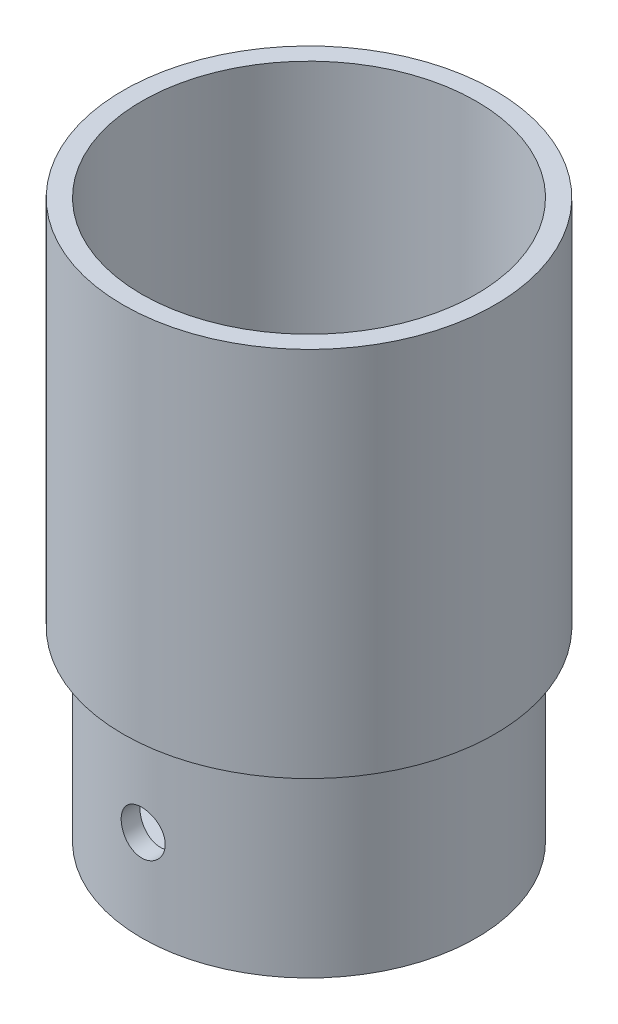
ISO-10303-21;
HEADER;
FILE_DESCRIPTION(('STEP AP214'),'2;1');
FILE_NAME('part.step','',(''),(''),'','','');
FILE_SCHEMA(('AUTOMOTIVE_DESIGN { 1 0 10303 214 1 1 1 1 }'));
ENDSEC;
DATA;
#1=APPLICATION_CONTEXT('core data for automotive mechanical design processes');
#2=APPLICATION_PROTOCOL_DEFINITION('international standard','automotive_design',2000,#1);
#3=PRODUCT_CONTEXT('',#1,'mechanical');
#4=PRODUCT('Part','Part','',(#3));
#5=PRODUCT_RELATED_PRODUCT_CATEGORY('part','',(#4));
#6=PRODUCT_DEFINITION_FORMATION('','',#4);
#7=PRODUCT_DEFINITION_CONTEXT('part definition',#1,'design');
#8=PRODUCT_DEFINITION('design','',#6,#7);
#9=PRODUCT_DEFINITION_SHAPE('','',#8);
#10=(LENGTH_UNIT() NAMED_UNIT(*) SI_UNIT(.MILLI.,.METRE.));
#11=(NAMED_UNIT(*) PLANE_ANGLE_UNIT() SI_UNIT($,.RADIAN.));
#12=(NAMED_UNIT(*) SI_UNIT($,.STERADIAN.) SOLID_ANGLE_UNIT());
#13=UNCERTAINTY_MEASURE_WITH_UNIT(LENGTH_MEASURE(1.E-05),#10,'distance_accuracy_value','');
#14=(GEOMETRIC_REPRESENTATION_CONTEXT(3) GLOBAL_UNCERTAINTY_ASSIGNED_CONTEXT((#13)) GLOBAL_UNIT_ASSIGNED_CONTEXT((#10,
#11,#12)) REPRESENTATION_CONTEXT('',''));
#15=CARTESIAN_POINT('',(0.,0.,0.));
#16=DIRECTION('',(0.,0.,1.));
#17=DIRECTION('',(1.,0.,0.));
#18=AXIS2_PLACEMENT_3D('',#15,#16,#17);
#19=CARTESIAN_POINT('',(0.,50.,0.));
#20=DIRECTION('',(0.,-1.,0.));
#21=DIRECTION('',(0.,0.,-1.));
#22=AXIS2_PLACEMENT_3D('',#19,#20,#21);
#23=CYLINDRICAL_SURFACE('',#22,45.);
#24=CARTESIAN_POINT('',(0.,30.4852633101779,-45.));
#25=CARTESIAN_POINT('',(-0.165602739226227,30.4852652960856,-45.0000006980719));
#26=CARTESIAN_POINT('',(-0.331176659897198,30.4783141520106,-44.9990840722904));
#27=CARTESIAN_POINT('',(-0.661192187234725,30.4505635068793,-44.9954446728699));
#28=CARTESIAN_POINT('',(-0.825633533508959,30.4297609219744,-44.9927214970259));
#29=CARTESIAN_POINT('',(-1.15227273725095,30.3744376839372,-44.985541916086));
#30=CARTESIAN_POINT('',(-1.31446887036562,30.3399070333473,-44.9810842478973));
#31=CARTESIAN_POINT('',(-1.6354060914179,30.2573704493001,-44.9705596376563));
#32=CARTESIAN_POINT('',(-1.79414589050943,30.2093595788339,-44.9644921060508));
#33=CARTESIAN_POINT('',(-2.10681880873609,30.100280049553,-44.9509263405974));
#34=CARTESIAN_POINT('',(-2.26075688414244,30.0392254024112,-44.9434296428879));
#35=CARTESIAN_POINT('',(-2.56298335612133,29.9044465244744,-44.927208109941));
#36=CARTESIAN_POINT('',(-2.71126964705121,29.8307176270241,-44.9184828225519));
#37=CARTESIAN_POINT('',(-3.00102411104392,29.6711775085326,-44.9000547965152));
#38=CARTESIAN_POINT('',(-3.14249592552196,29.5853728386916,-44.8903525886613));
#39=CARTESIAN_POINT('',(-3.41778284802502,29.4022235212981,-44.8702330958118));
#40=CARTESIAN_POINT('',(-3.55159509230303,29.3048745988471,-44.8598155465265));
#41=CARTESIAN_POINT('',(-3.81124226118932,29.0988218153305,-44.8385045412807));
#42=CARTESIAN_POINT('',(-3.93703339387869,28.9900629900847,-44.8276089439352));
#43=CARTESIAN_POINT('',(-4.17906669138164,28.7623195063106,-44.8056935692074));
#44=CARTESIAN_POINT('',(-4.29530530690043,28.6433310802118,-44.7946737473826));
#45=CARTESIAN_POINT('',(-4.51733735745226,28.3960296048563,-44.7728277772755));
#46=CARTESIAN_POINT('',(-4.62313407262495,28.267719505969,-44.7620015690535));
#47=CARTESIAN_POINT('',(-4.8236194793184,28.0025832278726,-44.7408411083437));
#48=CARTESIAN_POINT('',(-4.91830405870954,27.8657539245563,-44.730507038811));
#49=CARTESIAN_POINT('',(-5.09615041501729,27.5840950938397,-44.7105948199914));
#50=CARTESIAN_POINT('',(-5.17927206532667,27.439240031984,-44.7010193504172));
#51=CARTESIAN_POINT('',(-5.33303932531385,27.1429232306234,-44.6829350778253));
#52=CARTESIAN_POINT('',(-5.40368029103878,26.991459057957,-44.674426672193));
#53=CARTESIAN_POINT('',(-5.53190535373941,26.6830933196188,-44.6587304797958));
#54=CARTESIAN_POINT('',(-5.58949470018044,26.5261939693964,-44.6515421623025));
#55=CARTESIAN_POINT('',(-5.69124211427888,26.2080215287786,-44.6386867370429));
#56=CARTESIAN_POINT('',(-5.73539525322789,26.0467468569852,-44.6330201875854));
#57=CARTESIAN_POINT('',(-5.84666440864357,25.5600887711131,-44.6186329405704));
#58=CARTESIAN_POINT('',(-5.89347952542631,25.229725049942,-44.6124119766885));
#59=CARTESIAN_POINT('',(-5.93103499037306,24.5659567089546,-44.6074336672078));
#60=CARTESIAN_POINT('',(-5.92177782984717,24.2325522248977,-44.6086759900128));
#61=CARTESIAN_POINT('',(-5.84778711985859,23.5741755409795,-44.6184350316204));
#62=CARTESIAN_POINT('',(-5.78340564801423,23.2491632829478,-44.6269055827552));
#63=CARTESIAN_POINT('',(-5.60152391549611,22.6146087110283,-44.6500980576204));
#64=CARTESIAN_POINT('',(-5.4840224724664,22.3050667416519,-44.6648201204978));
#65=CARTESIAN_POINT('',(-5.1988659946871,21.7091353488346,-44.6989079438744));
#66=CARTESIAN_POINT('',(-5.03105887928966,21.4228195241428,-44.7182877496059));
#67=CARTESIAN_POINT('',(-4.6501617471528,20.8822790036918,-44.759497019881));
#68=CARTESIAN_POINT('',(-4.43706943637735,20.6280559347127,-44.7813266084981));
#69=CARTESIAN_POINT('',(-3.96970400656076,20.1568728461097,-44.8251807528828));
#70=CARTESIAN_POINT('',(-3.71512751498305,19.9402136458973,-44.8472055196468));
#71=CARTESIAN_POINT('',(-3.1730620432369,19.5526542490176,-44.888812024339));
#72=CARTESIAN_POINT('',(-2.88557297249947,19.3817541782749,-44.908393755544));
#73=CARTESIAN_POINT('',(-2.28560405892864,19.090560223312,-44.942921916731));
#74=CARTESIAN_POINT('',(-1.97311444023286,18.9702862514469,-44.9578665222235));
#75=CARTESIAN_POINT('',(-1.332133716924,18.7840030353496,-44.9814204142654));
#76=CARTESIAN_POINT('',(-1.00364344403722,18.7179909737234,-44.9900300297387));
#77=CARTESIAN_POINT('',(-0.342585910001201,18.6424977896412,-44.9999009224711));
#78=CARTESIAN_POINT('',(-0.0100667222296401,18.6326024781834,-45.0012160377143));
#79=CARTESIAN_POINT('',(0.651888078927484,18.6685290816453,-44.9964954073352));
#80=CARTESIAN_POINT('',(0.981323765081891,18.7143496783442,-44.9904598356279));
#81=CARTESIAN_POINT('',(1.62652995209473,18.8600632105735,-44.9717494518154));
#82=CARTESIAN_POINT('',(1.94234606168284,18.9597575930285,-44.9590990244207));
#83=CARTESIAN_POINT('',(2.55277797505874,19.21018166871,-44.9285745461136));
#84=CARTESIAN_POINT('',(2.84739298830586,19.3609132638037,-44.9107003005425));
#85=CARTESIAN_POINT('',(3.40890250396448,19.7101273240303,-44.8715850930635));
#86=CARTESIAN_POINT('',(3.67562985616852,19.9088764367082,-44.8503255652497));
#87=CARTESIAN_POINT('',(4.17208935747661,20.3481092218042,-44.8068732712481));
#88=CARTESIAN_POINT('',(4.40181987158219,20.5885947377007,-44.7846804638705));
#89=CARTESIAN_POINT('',(4.81924377005114,21.1062987685836,-44.741695474313));
#90=CARTESIAN_POINT('',(5.00666181756429,21.3837401950243,-44.7209130487079));
#91=CARTESIAN_POINT('',(5.3322340480126,21.9664206381172,-44.683266005724));
#92=CARTESIAN_POINT('',(5.47038930731056,22.2716590472388,-44.6664013027482));
#93=CARTESIAN_POINT('',(5.69307911959832,22.9003345882796,-44.6385648101359));
#94=CARTESIAN_POINT('',(5.77776633758819,23.2237170090512,-44.6275762564561));
#95=CARTESIAN_POINT('',(5.89158418656889,23.8804502683047,-44.6126963706914));
#96=CARTESIAN_POINT('',(5.92071770595236,24.2138005876123,-44.6088046696218));
#97=CARTESIAN_POINT('',(5.92215225825393,24.7123200521243,-44.6086083440165));
#98=CARTESIAN_POINT('',(5.91567761942845,24.8776912310413,-44.6094709040214));
#99=CARTESIAN_POINT('',(5.88892526035593,25.2072771157229,-44.6130114130493));
#100=CARTESIAN_POINT('',(5.86865268769549,25.3714922297046,-44.6156886850573));
#101=CARTESIAN_POINT('',(5.81443950913545,25.6976611300821,-44.6227859595752));
#102=CARTESIAN_POINT('',(5.78049394414966,25.859614073932,-44.6272065943769));
#103=CARTESIAN_POINT('',(5.69920467047371,26.180008394498,-44.6376606251521));
#104=CARTESIAN_POINT('',(5.65186582774958,26.3384510240586,-44.6436934353556));
#105=CARTESIAN_POINT('',(5.54413617938165,26.6507543875289,-44.6571998359716));
#106=CARTESIAN_POINT('',(5.48374653716861,26.8046155284712,-44.6646732979489));
#107=CARTESIAN_POINT('',(5.35037441326227,27.106645070667,-44.6808460258359));
#108=CARTESIAN_POINT('',(5.27739649417844,27.2548155108017,-44.6895448474064));
#109=CARTESIAN_POINT('',(5.11932385860098,27.5445524405905,-44.7079283051538));
#110=CARTESIAN_POINT('',(5.03422465824157,27.6861164605757,-44.7176133057551));
#111=CARTESIAN_POINT('',(4.85256199076153,27.9615597250764,-44.7376908956326));
#112=CARTESIAN_POINT('',(4.75600263452182,28.0954416998128,-44.7480832306131));
#113=CARTESIAN_POINT('',(4.55127306597554,28.3556687104583,-44.7693710428946));
#114=CARTESIAN_POINT('',(4.44301844147313,28.4819470773345,-44.7802698030547));
#115=CARTESIAN_POINT('',(4.21632153425253,28.7249041682835,-44.8021828938379));
#116=CARTESIAN_POINT('',(4.09788295161325,28.84158634899,-44.8131971812208));
#117=CARTESIAN_POINT('',(3.8515329838147,29.0646578811115,-44.835041988836));
#118=CARTESIAN_POINT('',(3.72361593316323,29.1710409874851,-44.8458723943265));
#119=CARTESIAN_POINT('',(3.45930950234515,29.3726509675784,-44.8670340472445));
#120=CARTESIAN_POINT('',(3.32292326929197,29.4678819478676,-44.8773654775819));
#121=CARTESIAN_POINT('',(3.04193858548534,29.6469699076332,-44.8972887068967));
#122=CARTESIAN_POINT('',(2.89730530036349,29.7307726500213,-44.9068768916614));
#123=CARTESIAN_POINT('',(2.60147602492128,29.8858499448168,-44.9249849611435));
#124=CARTESIAN_POINT('',(2.45028246891884,29.9571290956054,-44.9335052376421));
#125=CARTESIAN_POINT('',(2.14246805293296,30.0866254410577,-44.9492330541227));
#126=CARTESIAN_POINT('',(1.9858514702972,30.1448526710299,-44.9564416018532));
#127=CARTESIAN_POINT('',(1.66825418592253,30.2478691259702,-44.969347312378));
#128=CARTESIAN_POINT('',(1.50727451029162,30.2926614811466,-44.9750448271938));
#129=CARTESIAN_POINT('',(1.1245586090331,30.3818908416197,-44.9864842566963));
#130=CARTESIAN_POINT('',(0.901444900592205,30.4206147959806,-44.9915311263492));
#131=CARTESIAN_POINT('',(0.452202874935872,30.4722995652081,-44.9982885073289));
#132=CARTESIAN_POINT('',(0.22607458336464,30.4852605990918,-44.9999990470188));
#133=CARTESIAN_POINT('',(0.,30.4852633101779,-45.));
#134=B_SPLINE_CURVE_WITH_KNOTS('',3,(#24,#25,#26,#27,#28,#29,#30,#31,#32,#33,#34,#35,#36,#37,
#38,#39,#40,#41,#42,#43,#44,#45,#46,#47,#48,#49,#50,#51,#52,#53,#54,#55,#56,#57,#58,#59,#60,#61,
#62,#63,#64,#65,#66,#67,#68,#69,#70,#71,#72,#73,#74,#75,#76,#77,#78,#79,#80,#81,#82,#83,#84,#85,
#86,#87,#88,#89,#90,#91,#92,#93,#94,#95,#96,#97,#98,#99,#100,#101,#102,#103,#104,#105,#106,#107,
#108,#109,#110,#111,#112,#113,#114,#115,#116,#117,#118,#119,#120,#121,#122,#123,#124,#125,#126,
#127,#128,#129,#130,#131,#132,#133),.UNSPECIFIED.,.T.,.F.,(4,2,2,2,2,2,2,2,2,2,2,2,2,2,2,2,2,2,
2,2,2,2,2,2,2,2,2,2,2,2,2,2,2,2,2,2,2,2,2,2,2,2,2,2,2,2,2,2,2,2,2,2,2,2,4),(0.,
0.496610337576612,0.993331276166085,1.49041461612751,1.98768024637981,2.48441437402993,
2.9813317923341,3.4779806608907,3.97481401887093,4.47416138591716,4.9736934574148,
5.47306810688093,5.97262697485643,6.47387836927584,6.9753158839164,7.4765513570414,
7.97797047378749,8.97392015475526,9.96982558566901,10.9594172410026,11.9490309239686,
12.941667037355,13.934353447224,14.9346551161919,15.9349595378611,16.9356570343873,
17.9363025692837,18.9295527857819,19.9227795027521,20.9123703797516,21.9019981372455,
22.8972531189508,23.892552071822,24.8941520813165,25.895730205102,26.8944354767318,
27.8930888214567,28.389106303207,28.8849388373816,29.3809513682594,29.876783921718,
30.3725722917492,30.8681813398811,31.3639742005737,31.8595897495284,32.3590574770706,
32.858344496521,33.3579323964764,33.8573357498381,34.359032346758,34.8605443452392,
35.3616694103447,35.8626776268343,36.5406370020451,37.2185906137232),.UNSPECIFIED.);
#135=CARTESIAN_POINT('',(0.,30.4852633101779,-45.));
#136=VERTEX_POINT('',#135);
#137=EDGE_CURVE('E104',#136,#136,#134,.T.);
#138=ORIENTED_EDGE('',*,*,#137,.T.);
#139=EDGE_LOOP('',(#138));
#140=FACE_BOUND('',#139,.T.);
#141=CARTESIAN_POINT('',(5.92169968593746,24.5635636242404,44.6086703772884));
#142=CARTESIAN_POINT('',(5.9217016730348,24.3979678671453,44.6086696567049));
#143=CARTESIAN_POINT('',(5.91475110936843,24.2324009281947,44.6095943150669));
#144=CARTESIAN_POINT('',(5.88700283926012,23.9023995523414,44.6132648844858));
#145=CARTESIAN_POINT('',(5.86620204828423,23.7379653759559,44.6160112012371));
#146=CARTESIAN_POINT('',(5.81088371792735,23.411340669543,44.6232495980462));
#147=CARTESIAN_POINT('',(5.77635617149235,23.2491518658959,44.6277429516727));
#148=CARTESIAN_POINT('',(5.69382724752291,22.9282294581597,44.6383474317248));
#149=CARTESIAN_POINT('',(5.64582093210228,22.7694971433468,44.6444591509846));
#150=CARTESIAN_POINT('',(5.53675240314594,22.4568401449208,44.6581166999491));
#151=CARTESIAN_POINT('',(5.47570429293044,22.302910472211,44.6656609795197));
#152=CARTESIAN_POINT('',(5.3409400747721,22.0007000811478,44.6819758365931));
#153=CARTESIAN_POINT('',(5.26721930043444,21.8524214683163,44.6907468655936));
#154=CARTESIAN_POINT('',(5.10769667140649,21.5626809844646,44.7092593905481));
#155=CARTESIAN_POINT('',(5.02190135924115,21.4212154771502,44.7190003601143));
#156=CARTESIAN_POINT('',(4.83877161808571,21.1459394299342,44.7391861206929));
#157=CARTESIAN_POINT('',(4.74143291434267,21.0121317532498,44.7496311718191));
#158=CARTESIAN_POINT('',(4.53539034191461,20.7524782843321,44.7709840545992));
#159=CARTESIAN_POINT('',(4.42663038442528,20.6266771708279,44.7818939973369));
#160=CARTESIAN_POINT('',(4.19888252413321,20.3846238258208,44.8038220910266));
#161=CARTESIAN_POINT('',(4.07989085285579,20.2683751436991,44.8148402805123));
#162=CARTESIAN_POINT('',(3.83258089040819,20.0463234045482,44.836667185884));
#163=CARTESIAN_POINT('',(3.70426556303188,19.9405170531245,44.8474759669647));
#164=CARTESIAN_POINT('',(3.43911686134805,19.7400131241953,44.8685877426091));
#165=CARTESIAN_POINT('',(3.30228036271732,19.6453196584219,44.878890549149));
#166=CARTESIAN_POINT('',(3.02061584858071,19.4674632543562,44.8987290655279));
#167=CARTESIAN_POINT('',(2.87576284646978,19.3843395777164,44.9082621194037));
#168=CARTESIAN_POINT('',(2.5794500079191,19.2305680477487,44.9262560388212));
#169=CARTESIAN_POINT('',(2.42798773831768,19.1599248381807,44.9347165049427));
#170=CARTESIAN_POINT('',(2.11962588073288,19.0316951485964,44.9503167899435));
#171=CARTESIAN_POINT('',(1.9627285035851,18.9741034298892,44.9574571384873));
#172=CARTESIAN_POINT('',(1.64456041600793,18.8723511715924,44.9702219526336));
#173=CARTESIAN_POINT('',(1.48328812404858,18.8281955615638,44.9758458617851));
#174=CARTESIAN_POINT('',(0.996640912405773,18.7169193349983,44.9901213890121));
#175=CARTESIAN_POINT('',(0.666286657806594,18.6700987796061,44.9962888178975));
#176=CARTESIAN_POINT('',(0.00253689835840712,18.6325291678985,45.0012260090894));
#177=CARTESIAN_POINT('',(-0.330858474019623,18.641777680753,44.999996092102));
#178=CARTESIAN_POINT('',(-0.989272906802057,18.715754553318,44.9903214860683));
#179=CARTESIAN_POINT('',(-1.31433101105653,18.7801395452418,44.9819214506786));
#180=CARTESIAN_POINT('',(-1.94897544915129,18.9620441535392,44.9588970410598));
#181=CARTESIAN_POINT('',(-2.25856146212664,19.0795648713503,44.9442725378056));
#182=CARTESIAN_POINT('',(-2.85454681202467,19.3647615556432,44.9103663245768));
#183=CARTESIAN_POINT('',(-3.14087470108977,19.5325851552536,44.8910709386206));
#184=CARTESIAN_POINT('',(-3.68143238872088,19.9135176301081,44.8499794565339));
#185=CARTESIAN_POINT('',(-3.93566055560159,20.1266288059231,44.8281832333888));
#186=CARTESIAN_POINT('',(-4.40682288383316,20.5940078013227,44.7843324945592));
#187=CARTESIAN_POINT('',(-4.62346001811732,20.8485750961447,44.7622772728799));
#188=CARTESIAN_POINT('',(-5.01097924949364,21.3906142402718,44.7205567238754));
#189=CARTESIAN_POINT('',(-5.18186117369274,21.6780862139065,44.7008914055812));
#190=CARTESIAN_POINT('',(-5.47304199870023,22.2780501151631,44.666177688701));
#191=CARTESIAN_POINT('',(-5.59331545150944,22.5905545363309,44.6511316138844));
#192=CARTESIAN_POINT('',(-5.77959311096391,23.2315674908503,44.627404166128));
#193=CARTESIAN_POINT('',(-5.84560022715689,23.5600751651698,44.6187224519589));
#194=CARTESIAN_POINT('',(-5.92107471779648,24.2211413922611,44.6087697264911));
#195=CARTESIAN_POINT('',(-5.93096085197011,24.5536513392529,44.6074438297479));
#196=CARTESIAN_POINT('',(-5.89501919180575,25.2155854685304,44.6122075719548));
#197=CARTESIAN_POINT('',(-5.84919271714199,25.5450097237212,44.6182970352559));
#198=CARTESIAN_POINT('',(-5.70347994096159,26.1901559868361,44.6371552074326));
#199=CARTESIAN_POINT('',(-5.60379785076824,26.505924919519,44.6498986793565));
#200=CARTESIAN_POINT('',(-5.35341411996417,27.1162679025646,44.6806084610385));
#201=CARTESIAN_POINT('',(-5.20271050432071,27.4108411319108,44.6985749729754));
#202=CARTESIAN_POINT('',(-4.85353816800043,27.9723212061262,44.7378374234563));
#203=CARTESIAN_POINT('',(-4.65479570607237,28.2390564781002,44.7591521885412));
#204=CARTESIAN_POINT('',(-4.21557142909375,28.7355350467972,44.8026509808007));
#205=CARTESIAN_POINT('',(-3.97508781072448,28.9652767444814,44.824835045499));
#206=CARTESIAN_POINT('',(-3.45737910698005,29.3827262004716,44.8677423324108));
#207=CARTESIAN_POINT('',(-3.17993073109918,29.5701582076672,44.8884554003544));
#208=CARTESIAN_POINT('',(-2.59723253501294,29.8957549114998,44.9259331164041));
#209=CARTESIAN_POINT('',(-2.29198332662359,30.0339206920154,44.9426978513727));
#210=CARTESIAN_POINT('',(-1.66331347468755,30.2566171675289,44.9703469641802));
#211=CARTESIAN_POINT('',(-1.33994916891306,30.3413050835821,44.9812485650623));
#212=CARTESIAN_POINT('',(-0.683254273459226,30.4551304790413,44.9960077160057));
#213=CARTESIAN_POINT('',(-0.349924185240251,30.4842707487434,44.9998656198889));
#214=CARTESIAN_POINT('',(0.148590951351719,30.4857204446677,45.0000620264808));
#215=CARTESIAN_POINT('',(0.313977245864337,30.4792496454715,44.9992075777103));
#216=CARTESIAN_POINT('',(0.643593802819265,30.4525023918654,44.995698154543));
#217=CARTESIAN_POINT('',(0.807824473276999,30.4322310855313,44.9930438515568));
#218=CARTESIAN_POINT('',(1.13402473259007,30.3780177645708,44.9860049414306));
#219=CARTESIAN_POINT('',(1.29599348082889,30.3440708004563,44.9816197078447));
#220=CARTESIAN_POINT('',(1.61641946878476,30.2627759350043,44.9712448981201));
#221=CARTESIAN_POINT('',(1.77487796184981,30.2154329027311,44.9652559049417));
#222=CARTESIAN_POINT('',(2.08721449077045,30.1076914236804,44.9518405889219));
#223=CARTESIAN_POINT('',(2.24109288021488,30.0472939877064,44.944414377369));
#224=CARTESIAN_POINT('',(2.54315572749954,29.913903315238,44.928334358059));
#225=CARTESIAN_POINT('',(2.69134222529819,29.8409146438929,44.9196809954264));
#226=CARTESIAN_POINT('',(2.98110930216512,29.6828179329743,44.9013816442419));
#227=CARTESIAN_POINT('',(3.12268741511332,29.5977054162741,44.8917352893618));
#228=CARTESIAN_POINT('',(3.39815634165586,29.4160140350217,44.8717238502038));
#229=CARTESIAN_POINT('',(3.53204988722647,29.3194392833951,44.8613590242827));
#230=CARTESIAN_POINT('',(3.79227692832766,29.1146932274458,44.8401138606804));
#231=CARTESIAN_POINT('',(3.91854507460976,29.0064391995203,44.8292301978482));
#232=CARTESIAN_POINT('',(4.16148159521089,28.7797456016103,44.8073313661442));
#233=CARTESIAN_POINT('',(4.27815342612928,28.6613097308501,44.796316246275));
#234=CARTESIAN_POINT('',(4.50120460747079,28.4149672337529,44.7744539443036));
#235=CARTESIAN_POINT('',(4.60757770105156,28.2870549324143,44.763606867613));
#236=CARTESIAN_POINT('',(4.80916836181596,28.0227599935862,44.7423979230603));
#237=CARTESIAN_POINT('',(4.90439003373144,27.8863805012528,44.7320358775113));
#238=CARTESIAN_POINT('',(5.083466902606,27.6054009478394,44.7120400248784));
#239=CARTESIAN_POINT('',(5.16726702301953,27.4607655172349,44.7024098391618));
#240=CARTESIAN_POINT('',(5.32233886108176,27.1649321891721,44.6842120256213));
#241=CARTESIAN_POINT('',(5.393615177373,27.013736726042,44.6756440081191));
#242=CARTESIAN_POINT('',(5.52310572005785,26.7059185356916,44.6598204214201));
#243=CARTESIAN_POINT('',(5.58132999542204,26.5493000917144,44.6525638433654));
#244=CARTESIAN_POINT('',(5.68434047461924,26.2316987389223,44.6395672145619));
#245=CARTESIAN_POINT('',(5.72912981110023,26.0707168570983,44.6338268103216));
#246=CARTESIAN_POINT('',(5.81834632380437,25.6880189360763,44.6222990496288));
#247=CARTESIAN_POINT('',(5.8570630811233,25.4649258834582,44.6172106031646));
#248=CARTESIAN_POINT('',(5.90873829287289,25.0157251769394,44.6103967735841));
#249=CARTESIAN_POINT('',(5.921696973361,24.7896175495126,44.6086713609533));
#250=CARTESIAN_POINT('',(5.92169968593746,24.5635636242404,44.6086703772884));
#251=B_SPLINE_CURVE_WITH_KNOTS('',3,(#141,#142,#143,#144,#145,#146,#147,#148,#149,#150,#151,
#152,#153,#154,#155,#156,#157,#158,#159,#160,#161,#162,#163,#164,#165,#166,#167,#168,#169,#170,
#171,#172,#173,#174,#175,#176,#177,#178,#179,#180,#181,#182,#183,#184,#185,#186,#187,#188,#189,
#190,#191,#192,#193,#194,#195,#196,#197,#198,#199,#200,#201,#202,#203,#204,#205,#206,#207,#208,
#209,#210,#211,#212,#213,#214,#215,#216,#217,#218,#219,#220,#221,#222,#223,#224,#225,#226,#227,
#228,#229,#230,#231,#232,#233,#234,#235,#236,#237,#238,#239,#240,#241,#242,#243,#244,#245,#246,
#247,#248,#249,#250),.UNSPECIFIED.,.T.,.F.,(4,2,2,2,2,2,2,2,2,2,2,2,2,2,2,2,2,2,2,2,2,2,2,2,2,2,
2,2,2,2,2,2,2,2,2,2,2,2,2,2,2,2,2,2,2,2,2,2,2,2,2,2,2,2,4),(0.,0.496589368233186,
0.993289367092624,1.49035213523076,1.98759723820275,2.48430732081328,2.98120069794551,
3.47782586524283,3.97463552064754,4.47401045240085,4.97357010485555,5.47297164673184,
5.97255738687406,6.47379914469758,6.97522701466852,7.47645326042096,7.97786317947545,
8.97378565933328,9.96966496206864,10.9593870596436,11.9491296738671,12.9418059937779,
13.9345327528744,14.9347779020586,15.9350268307689,16.9357781260266,17.9364757614326,
18.9296965442686,19.9228938009699,20.9123511866886,21.9018468784789,22.8971197813603,
23.8924356931408,24.8940623801196,25.8956670295118,26.8943131537475,27.8929091121861,
28.3889713241985,28.884848588833,29.3809054826158,29.8767823058662,30.3726207470821,
30.8682797907069,31.3641223494739,31.8597875228658,32.359227972349,32.8584877279399,
33.3580489225532,33.8574256516141,34.3591311460775,34.8606520314768,35.3617854516937,
35.8628019307664,36.5406994995091,37.2185911188762),.UNSPECIFIED.);
#252=CARTESIAN_POINT('',(5.92169968593746,24.5635636242404,44.6086703772884));
#253=VERTEX_POINT('',#252);
#254=EDGE_CURVE('E99',#253,#253,#251,.T.);
#255=ORIENTED_EDGE('',*,*,#254,.T.);
#256=EDGE_LOOP('',(#255));
#257=FACE_BOUND('',#256,.T.);
#258=CARTESIAN_POINT('',(0.,50.,0.));
#259=DIRECTION('',(0.,1.,0.));
#260=DIRECTION('',(0.,0.,1.));
#261=AXIS2_PLACEMENT_3D('',#258,#259,#260);
#262=CIRCLE('',#261,45.);
#263=CARTESIAN_POINT('',(0.,50.,45.));
#264=VERTEX_POINT('',#263);
#265=EDGE_CURVE('E12',#264,#264,#262,.T.);
#266=ORIENTED_EDGE('',*,*,#265,.F.);
#267=EDGE_LOOP('',(#266));
#268=FACE_BOUND('',#267,.T.);
#269=CARTESIAN_POINT('',(0.,0.,0.));
#270=DIRECTION('',(0.,1.,0.));
#271=DIRECTION('',(0.,0.,1.));
#272=AXIS2_PLACEMENT_3D('',#269,#270,#271);
#273=CIRCLE('',#272,45.);
#274=CARTESIAN_POINT('',(0.,0.,45.));
#275=VERTEX_POINT('',#274);
#276=EDGE_CURVE('E93',#275,#275,#273,.T.);
#277=ORIENTED_EDGE('',*,*,#276,.T.);
#278=EDGE_LOOP('',(#277));
#279=FACE_BOUND('',#278,.T.);
#280=ADVANCED_FACE('F51',(#140,#257,#268,#279),#23,.T.);
#281=CARTESIAN_POINT('',(0.,0.,0.));
#282=DIRECTION('',(0.,1.,0.));
#283=DIRECTION('',(0.,0.,1.));
#284=AXIS2_PLACEMENT_3D('',#281,#282,#283);
#285=PLANE('',#284);
#286=DIRECTION('',(0.,0.,1.));
#287=VECTOR('',#286,1.);
#288=CARTESIAN_POINT('',(-3.01226675034075,0.,7.71893354774802));
#289=LINE('',#288,#287);
#290=CARTESIAN_POINT('',(-3.01226675034075,0.,-5.80650011790681));
#291=VERTEX_POINT('',#290);
#292=CARTESIAN_POINT('',(-3.01226675034075,0.,5.80650011790681));
#293=VERTEX_POINT('',#292);
#294=EDGE_CURVE('E81',#291,#293,#289,.T.);
#295=ORIENTED_EDGE('',*,*,#294,.T.);
#296=CARTESIAN_POINT('',(0.,0.,0.));
#297=DIRECTION('',(0.,-1.,0.));
#298=DIRECTION('',(0.,0.,-1.));
#299=AXIS2_PLACEMENT_3D('',#296,#297,#298);
#300=CIRCLE('',#299,6.54134501417409);
#301=EDGE_CURVE('E74',#291,#293,#300,.T.);
#302=ORIENTED_EDGE('',*,*,#301,.F.);
#303=EDGE_LOOP('',(#295,#302));
#304=FACE_BOUND('',#303,.T.);
#305=ORIENTED_EDGE('',*,*,#276,.F.);
#306=EDGE_LOOP('',(#305));
#307=FACE_BOUND('',#306,.T.);
#308=ADVANCED_FACE('F78',(#304,#307),#285,.F.);
#309=CARTESIAN_POINT('',(0.,10.,0.));
#310=DIRECTION('',(0.,1.,0.));
#311=DIRECTION('',(0.,0.,1.));
#312=AXIS2_PLACEMENT_3D('',#309,#310,#311);
#313=CYLINDRICAL_SURFACE('',#312,40.);
#314=CARTESIAN_POINT('',(0.,18.6418639383029,40.));
#315=CARTESIAN_POINT('',(0.165400078830967,18.6418617144572,40.0000008702031));
#316=CARTESIAN_POINT('',(0.330768869389246,18.6487959771474,39.9989721460615));
#317=CARTESIAN_POINT('',(0.660372723269405,18.6764777295679,39.9948878579096));
#318=CARTESIAN_POINT('',(0.824607538964431,18.697228145605,39.9918318645174));
#319=CARTESIAN_POINT('',(1.15082526057968,18.7524090491233,39.9837748246962));
#320=CARTESIAN_POINT('',(1.31280654339526,18.7868489169138,39.9787724446105));
#321=CARTESIAN_POINT('',(1.63331522450072,18.8691635115868,39.9669614411459));
#322=CARTESIAN_POINT('',(1.79184133351693,18.9170431639772,39.9601521556096));
#323=CARTESIAN_POINT('',(2.10408302771323,19.0258146811797,39.9449276165464));
#324=CARTESIAN_POINT('',(2.25780382894313,19.0866918323822,39.9365141801153));
#325=CARTESIAN_POINT('',(2.55960719667997,19.2210703840971,39.9183075341426));
#326=CARTESIAN_POINT('',(2.70768766131692,19.2945764356104,39.9085138165075));
#327=CARTESIAN_POINT('',(2.99705283787668,19.4536277220235,39.8878265497214));
#328=CARTESIAN_POINT('',(3.13834104835595,19.539166667905,39.8769335759342));
#329=CARTESIAN_POINT('',(3.41328884008039,19.7217427393424,39.8543410019326));
#330=CARTESIAN_POINT('',(3.54694556332148,19.8187841312739,39.8426411030985));
#331=CARTESIAN_POINT('',(3.80649776046817,20.0243256089331,39.8186849719143));
#332=CARTESIAN_POINT('',(3.93233766250083,20.1328955137263,39.8064256400375));
#333=CARTESIAN_POINT('',(4.17448772381301,20.3602586723982,39.7817605571756));
#334=CARTESIAN_POINT('',(4.29079433944853,20.4790556944867,39.7693547536877));
#335=CARTESIAN_POINT('',(4.51298639561086,20.7259788094251,39.744753710526));
#336=CARTESIAN_POINT('',(4.6188750597979,20.8541019949644,39.7325584066857));
#337=CARTESIAN_POINT('',(4.81957012757754,21.11887532982,39.7087139424585));
#338=CARTESIAN_POINT('',(4.9143724290426,21.255528606898,39.6970649851771));
#339=CARTESIAN_POINT('',(5.09257400934061,21.5370006127339,39.6745988702489));
#340=CARTESIAN_POINT('',(5.17592081666203,21.6818528869507,39.6637856333881));
#341=CARTESIAN_POINT('',(5.33013569627396,21.9782015399707,39.6433563939914));
#342=CARTESIAN_POINT('',(5.40099911634803,22.1297003696022,39.6337408381879));
#343=CARTESIAN_POINT('',(5.52966002807093,22.4381726231679,39.6159953809916));
#344=CARTESIAN_POINT('',(5.58746288836358,22.5951437669251,39.6078648694242));
#345=CARTESIAN_POINT('',(5.68962268364769,22.9134962672842,39.5933178299288));
#346=CARTESIAN_POINT('',(5.73397469534275,23.0748792151959,39.5869019296868));
#347=CARTESIAN_POINT('',(5.84569322261417,23.56141766799,39.5706182063196));
#348=CARTESIAN_POINT('',(5.89281075771314,23.8915822484494,39.5635589518244));
#349=CARTESIAN_POINT('',(5.93102091141989,24.5550206989515,39.5578477908504));
#350=CARTESIAN_POINT('',(5.922116664568,24.8882943939907,39.5591954139884));
#351=CARTESIAN_POINT('',(5.84893951167782,25.5458727606651,39.570080060009));
#352=CARTESIAN_POINT('',(5.7851141246783,25.8702281152787,39.5795508897989));
#353=CARTESIAN_POINT('',(5.60458700336931,26.5035615575079,39.6055153057122));
#354=CARTESIAN_POINT('',(5.48788380878263,26.8125392201906,39.6220090857811));
#355=CARTESIAN_POINT('',(5.20445223325418,27.4077265710488,39.6602332480476));
#356=CARTESIAN_POINT('',(5.03753383096207,27.693844455535,39.6819834587139));
#357=CARTESIAN_POINT('',(4.65854400852798,28.2341785585408,39.7282556455344));
#358=CARTESIAN_POINT('',(4.44646970063144,28.4883927351405,39.7527777989092));
#359=CARTESIAN_POINT('',(3.98072925346208,28.9602990664583,39.8021234984816));
#360=CARTESIAN_POINT('',(3.72667815917648,29.1776114137,39.8269476540308));
#361=CARTESIAN_POINT('',(3.18550877645347,29.5665725804101,39.8738783881646));
#362=CARTESIAN_POINT('',(2.89839034992984,29.7382212091809,39.8959849554));
#363=CARTESIAN_POINT('',(2.29891042700077,30.0310004450349,39.935011935153));
#364=CARTESIAN_POINT('',(1.9865346423812,30.1521022154286,39.9519293858546));
#365=CARTESIAN_POINT('',(1.34557361537365,30.340022316051,39.9786470826469));
#366=CARTESIAN_POINT('',(1.01698944165183,30.4068442200481,39.9884477972965));
#367=CARTESIAN_POINT('',(0.356217470666942,30.4838038047811,39.9997657881593));
#368=CARTESIAN_POINT('',(0.0240917580591412,30.4944637346497,40.0013593791222));
#369=CARTESIAN_POINT('',(-0.637205092292992,30.4601823035625,39.9962911616265));
#370=CARTESIAN_POINT('',(-0.966376318762549,30.415242617966,39.9896296019168));
#371=CARTESIAN_POINT('',(-1.61084179447009,30.2714718973866,39.9688467993733));
#372=CARTESIAN_POINT('',(-1.92619393379281,30.1728948407002,39.9547607221338));
#373=CARTESIAN_POINT('',(-2.53589427082073,29.9249150454819,39.9207034009846));
#374=CARTESIAN_POINT('',(-2.83024150361055,29.7755099738481,39.900731886928));
#375=CARTESIAN_POINT('',(-3.39187612314006,29.4288870633284,39.8569339371677));
#376=CARTESIAN_POINT('',(-3.65895661761181,29.2313373886891,39.8330811463652));
#377=CARTESIAN_POINT('',(-4.15635948895594,28.7944944192866,39.7842588884263));
#378=CARTESIAN_POINT('',(-4.38667978641743,28.5551987646835,39.7592893582216));
#379=CARTESIAN_POINT('',(-4.80592102565566,28.0393380826092,39.7108062447814));
#380=CARTESIAN_POINT('',(-4.99449220557475,27.7624873797781,39.6873060647639));
#381=CARTESIAN_POINT('',(-5.32245090002613,27.1807204767594,39.6446590254004));
#382=CARTESIAN_POINT('',(-5.46183971615591,26.8758050195669,39.6255120508529));
#383=CARTESIAN_POINT('',(-5.68693860089773,26.2476770197108,39.5938337034641));
#384=CARTESIAN_POINT('',(-5.77283382137528,25.924531858227,39.5812795355479));
#385=CARTESIAN_POINT('',(-5.88907565757714,25.2680193203855,39.5641553772984));
#386=CARTESIAN_POINT('',(-5.91942600134509,24.9346526316002,39.5595848511224));
#387=CARTESIAN_POINT('',(-5.92264532209906,24.43630533077,39.559096281038));
#388=CARTESIAN_POINT('',(-5.91678507600111,24.2711987874397,39.5599769223377));
#389=CARTESIAN_POINT('',(-5.89130579429709,23.9420911023502,39.5637805084622));
#390=CARTESIAN_POINT('',(-5.87169190607423,23.77808957021,39.5667026892271));
#391=CARTESIAN_POINT('',(-5.81883766614554,23.4522965210023,39.5745098268553));
#392=CARTESIAN_POINT('',(-5.78559240376393,23.2905058221103,39.579395491047));
#393=CARTESIAN_POINT('',(-5.70574258109936,22.9703819118837,39.5909854621127));
#394=CARTESIAN_POINT('',(-5.65914285310648,22.8120474721701,39.5976891111051));
#395=CARTESIAN_POINT('',(-5.55294296457809,22.4999467116672,39.6127213891564));
#396=CARTESIAN_POINT('',(-5.49334759087919,22.3461787324933,39.6210494197692));
#397=CARTESIAN_POINT('',(-5.36160415412422,22.044269162369,39.6390920298834));
#398=CARTESIAN_POINT('',(-5.28946061599096,21.8961255666219,39.6488061093434));
#399=CARTESIAN_POINT('',(-5.13309164074484,21.6063671922669,39.6693532528419));
#400=CARTESIAN_POINT('',(-5.04886161291703,21.4647549215296,39.6801867416171));
#401=CARTESIAN_POINT('',(-4.86896462031739,21.1891326826786,39.7026623053459));
#402=CARTESIAN_POINT('',(-4.77330172106773,21.0551200369909,39.7143040922558));
#403=CARTESIAN_POINT('',(-4.57019070407811,20.7942836289547,39.7381920938932));
#404=CARTESIAN_POINT('',(-4.46263683464023,20.6675426382908,39.7504430928029));
#405=CARTESIAN_POINT('',(-4.2373083903589,20.4235991841804,39.7750933913233));
#406=CARTESIAN_POINT('',(-4.11953750653828,20.306393305464,39.7874926359942));
#407=CARTESIAN_POINT('',(-3.8744815702412,20.0822118888396,39.8121032110038));
#408=CARTESIAN_POINT('',(-3.74719085496459,19.9752425276747,39.8243144242016));
#409=CARTESIAN_POINT('',(-3.48408453389112,19.7723983310384,39.8481943618067));
#410=CARTESIAN_POINT('',(-3.34827209406089,19.6765194124817,39.8598632849123));
#411=CARTESIAN_POINT('',(-3.06821416783286,19.4959700409502,39.8824009458096));
#412=CARTESIAN_POINT('',(-2.92392473680445,19.4113671079698,39.8932647042213));
#413=CARTESIAN_POINT('',(-2.62869672332894,19.2546653792085,39.9138051262459));
#414=CARTESIAN_POINT('',(-2.47776060993307,19.182561988531,39.9234822256965));
#415=CARTESIAN_POINT('',(-2.17036555987521,19.0514008063224,39.9413718923097));
#416=CARTESIAN_POINT('',(-2.01391078666621,18.9923334142425,39.9495855363904));
#417=CARTESIAN_POINT('',(-1.69654640791612,18.8876334777205,39.9643213096662));
#418=CARTESIAN_POINT('',(-1.53563781315937,18.8419979118678,39.9708438192328));
#419=CARTESIAN_POINT('',(-1.14849834618518,18.7497249875036,39.9841385234719));
#420=CARTESIAN_POINT('',(-0.920722959340329,18.7093219705769,39.9900602193901));
#421=CARTESIAN_POINT('',(-0.461944689943075,18.6553931590651,39.9979903267622));
#422=CARTESIAN_POINT('',(-0.230941845983207,18.6418670433743,39.9999987849685));
#423=CARTESIAN_POINT('',(0.,18.6418639383029,40.));
#424=B_SPLINE_CURVE_WITH_KNOTS('',3,(#314,#315,#316,#317,#318,#319,#320,#321,#322,#323,#324,
#325,#326,#327,#328,#329,#330,#331,#332,#333,#334,#335,#336,#337,#338,#339,#340,#341,#342,#343,
#344,#345,#346,#347,#348,#349,#350,#351,#352,#353,#354,#355,#356,#357,#358,#359,#360,#361,#362,
#363,#364,#365,#366,#367,#368,#369,#370,#371,#372,#373,#374,#375,#376,#377,#378,#379,#380,#381,
#382,#383,#384,#385,#386,#387,#388,#389,#390,#391,#392,#393,#394,#395,#396,#397,#398,#399,#400,
#401,#402,#403,#404,#405,#406,#407,#408,#409,#410,#411,#412,#413,#414,#415,#416,#417,#418,#419,
#420,#421,#422,#423),.UNSPECIFIED.,.T.,.F.,(4,2,2,2,2,2,2,2,2,2,2,2,2,2,2,2,2,2,2,2,2,2,2,2,2,2,
2,2,2,2,2,2,2,2,2,2,2,2,2,2,2,2,2,2,2,2,2,2,2,2,2,2,2,2,4),(0.,0.495997973047831,
0.992101033533355,1.48854462223526,1.98517038919171,2.48123691188742,2.97748652026873,
3.47347771975909,3.96965346658178,4.4690270025095,4.96858532801083,5.46798858416845,
5.96757604653841,6.469380583642,6.97137173573865,7.47315616357696,7.975124034129,
8.97064656414848,9.96611339301642,10.953544759017,11.9410033956528,12.9322467482258,
13.9235535106156,14.9245147952409,15.9254802599427,16.9270159916967,17.9284857773264,
18.9206262635387,19.912736854735,20.9001900748012,21.8876886269545,22.8821961844549,
23.8767599782556,24.8793646587308,25.8819428035632,26.8810312559582,27.880052649388,
28.3752089085456,28.8701799513357,29.3653294633564,29.8603000321295,30.3550885897009,
30.8496990928796,31.3444979597464,31.8391213970526,32.3385644099425,32.837827738294,
33.3373904486743,33.8367686494292,34.3390142718199,34.8410748727912,35.3427644809301,
35.8443411505334,36.5368925498733,37.2294356750593),.UNSPECIFIED.);
#425=CARTESIAN_POINT('',(0.,18.6418639383029,40.));
#426=VERTEX_POINT('',#425);
#427=EDGE_CURVE('E92',#426,#426,#424,.T.);
#428=ORIENTED_EDGE('',*,*,#427,.T.);
#429=EDGE_LOOP('',(#428));
#430=FACE_BOUND('',#429,.T.);
#431=CARTESIAN_POINT('',(5.92169968593746,24.5635636242404,-39.5592400436304));
#432=CARTESIAN_POINT('',(5.92170191198373,24.3981747153575,-39.5592391377816));
#433=CARTESIAN_POINT('',(5.91476857649891,24.2328170951034,-39.5602792842278));
#434=CARTESIAN_POINT('',(5.88709061896181,23.9032358834581,-39.5644078844302));
#435=CARTESIAN_POINT('',(5.86634306954784,23.7390125398851,-39.5674967723334));
#436=CARTESIAN_POINT('',(5.81117000739489,23.4128180121946,-39.5756374108136));
#437=CARTESIAN_POINT('',(5.77673509864264,23.250848454461,-39.5806905097173));
#438=CARTESIAN_POINT('',(5.69443274096171,22.9303634727528,-39.5926150193465));
#439=CARTESIAN_POINT('',(5.64656036512236,22.7718493387423,-39.5994870969564));
#440=CARTESIAN_POINT('',(5.53780641971232,22.4596331187571,-39.6148420337834));
#441=CARTESIAN_POINT('',(5.47693970987795,22.3059257642358,-39.6233230518649));
#442=CARTESIAN_POINT('',(5.34258457434798,22.0041481371726,-39.64166224596));
#443=CARTESIAN_POINT('',(5.26909149806993,21.8560799663092,-39.651520929149));
#444=CARTESIAN_POINT('',(5.11006815069425,21.5667371859124,-39.6723282273689));
#445=CARTESIAN_POINT('',(5.02454415487984,21.4254590859192,-39.6832762733264));
#446=CARTESIAN_POINT('',(4.84199936332306,21.1505287434122,-39.7059630416088));
#447=CARTESIAN_POINT('',(4.74497430144057,21.0168793580562,-39.7177020566301));
#448=CARTESIAN_POINT('',(4.53944917464318,20.7573171423956,-39.7417182856458));
#449=CARTESIAN_POINT('',(4.43087749235093,20.6314612965162,-39.7539985444899));
#450=CARTESIAN_POINT('',(4.20350740428521,20.3892792018512,-39.778682772421));
#451=CARTESIAN_POINT('',(4.08470522885542,20.2729564968457,-39.7910867856067));
#452=CARTESIAN_POINT('',(3.83776861125139,20.0507329607817,-39.8156617243711));
#453=CARTESIAN_POINT('',(3.70963709788047,19.9448288832919,-39.8278327215992));
#454=CARTESIAN_POINT('',(3.44484395298096,19.7441041746315,-39.8516087981185));
#455=CARTESIAN_POINT('',(3.30817919334775,19.6492876449435,-39.8632136670693));
#456=CARTESIAN_POINT('',(3.02669804007858,19.4710699140942,-39.8855752312763));
#457=CARTESIAN_POINT('',(2.88184897437304,19.3877198098252,-39.8963280448265));
#458=CARTESIAN_POINT('',(2.58550647073788,19.2334980003418,-39.9166284499931));
#459=CARTESIAN_POINT('',(2.43401058197556,19.1626309470357,-39.9261755919329));
#460=CARTESIAN_POINT('',(2.12554432014344,19.0339625636004,-39.9437840872029));
#461=CARTESIAN_POINT('',(1.96857621983952,18.9761558820232,-39.9518460488304));
#462=CARTESIAN_POINT('',(1.65023045571723,18.8739883052284,-39.9662635278473));
#463=CARTESIAN_POINT('',(1.48885120036965,18.8296323346907,-39.9726184201341));
#464=CARTESIAN_POINT('',(1.00233024677798,18.7179026295524,-39.9887423377679));
#465=CARTESIAN_POINT('',(0.672181053392659,18.6707764928462,-39.9957249016107));
#466=CARTESIAN_POINT('',(0.00877285763284207,18.6325438206449,-40.0013769318311));
#467=CARTESIAN_POINT('',(-0.324485975158041,18.6414342479198,-40.0000468489223));
#468=CARTESIAN_POINT('',(-0.982124282094297,18.7145891444145,-39.9892822949408));
#469=CARTESIAN_POINT('',(-1.30655281489851,18.7784200199516,-39.979911285181));
#470=CARTESIAN_POINT('',(-1.94002975956034,18.9589833393965,-39.9541847039841));
#471=CARTESIAN_POINT('',(-2.24907778372767,19.0757171160578,-39.937828956585));
#472=CARTESIAN_POINT('',(-2.84435188533356,19.3592127744085,-39.8998624934066));
#473=CARTESIAN_POINT('',(-3.13048954225558,19.5261576693758,-39.8782326095968));
#474=CARTESIAN_POINT('',(-3.67085203109748,19.9052044475362,-39.8321290308797));
#475=CARTESIAN_POINT('',(-3.92507481436742,20.1173092272368,-39.8076551536074));
#476=CARTESIAN_POINT('',(-4.39694814339503,20.5830717693674,-39.7583171038365));
#477=CARTESIAN_POINT('',(-4.61422499010167,20.8371081480109,-39.7334514384441));
#478=CARTESIAN_POINT('',(-5.0031214727646,21.3782352717517,-39.6863612476837));
#479=CARTESIAN_POINT('',(-5.17474084120091,21.6653262105109,-39.6641367377915));
#480=CARTESIAN_POINT('',(-5.46749882283219,22.2647977032127,-39.6248456942596));
#481=CARTESIAN_POINT('',(-5.58859974212624,22.5771969339136,-39.6077830146739));
#482=CARTESIAN_POINT('',(-5.77651100164733,23.2182090678392,-39.5808162783114));
#483=CARTESIAN_POINT('',(-5.84332506397832,23.546820857833,-39.5709117307522));
#484=CARTESIAN_POINT('',(-5.92025498283725,24.2076072137299,-39.5594755055814));
#485=CARTESIAN_POINT('',(-5.93090026129251,24.5397188377167,-39.5578656493103));
#486=CARTESIAN_POINT('',(-5.89659455556445,25.200984028995,-39.5629935890432));
#487=CARTESIAN_POINT('',(-5.85164525021176,25.530137685308,-39.5697311329747));
#488=CARTESIAN_POINT('',(-5.70787509501051,26.1745078543286,-39.5907229473394));
#489=CARTESIAN_POINT('',(-5.60931737907629,26.4897843777882,-39.6049404915295));
#490=CARTESIAN_POINT('',(-5.36140148648458,27.0993420029013,-39.6392601019645));
#491=CARTESIAN_POINT('',(-5.21204086096704,27.3936220916333,-39.659362451869));
#492=CARTESIAN_POINT('',(-4.86548475741384,27.9552084557648,-39.7033711034953));
#493=CARTESIAN_POINT('',(-4.66794619173562,28.222300870539,-39.7273042452512));
#494=CARTESIAN_POINT('',(-4.23111803462627,28.7197329402604,-39.7761966584394));
#495=CARTESIAN_POINT('',(-3.99182614549369,28.9500705712414,-39.8011559862851));
#496=CARTESIAN_POINT('',(-3.47595844700185,29.3693528602611,-39.849532621633));
#497=CARTESIAN_POINT('',(-3.1990961824059,29.5579469128191,-39.8729357921328));
#498=CARTESIAN_POINT('',(-2.61729971413683,29.8859456939671,-39.9153436655543));
#499=CARTESIAN_POINT('',(-2.31236626240818,30.0253517396759,-39.934348486247));
#500=CARTESIAN_POINT('',(-1.68424671696128,30.2504612770794,-39.965758434233));
#501=CARTESIAN_POINT('',(-1.3611307039787,30.3363573714601,-39.9781872065917));
#502=CARTESIAN_POINT('',(-0.704680007911039,30.452610846951,-39.9951360090347));
#503=CARTESIAN_POINT('',(-0.371345982869707,30.4829717969367,-39.9996565473279));
#504=CARTESIAN_POINT('',(0.126993532323332,30.4862152676965,-40.0001430182445));
#505=CARTESIAN_POINT('',(0.292123755299226,30.480361263897,-39.9992731521283));
#506=CARTESIAN_POINT('',(0.621279508856706,30.454890441768,-39.9955122688461));
#507=CARTESIAN_POINT('',(0.785305429493124,30.4352787715167,-39.9926220077075));
#508=CARTESIAN_POINT('',(1.11114767755747,30.3824247805216,-39.9848964936917));
#509=CARTESIAN_POINT('',(1.27296318976662,30.3491775640169,-39.980060542238));
#510=CARTESIAN_POINT('',(1.59313686914275,30.2693194522975,-39.9685821633163));
#511=CARTESIAN_POINT('',(1.75149626544364,30.2227133942015,-39.9619403897653));
#512=CARTESIAN_POINT('',(2.0636501578438,30.1164951263967,-39.9470369392451));
#513=CARTESIAN_POINT('',(2.21744620343679,30.0568873901972,-39.9387758195458));
#514=CARTESIAN_POINT('',(2.51941002861534,29.9251144186931,-39.9208647571474));
#515=CARTESIAN_POINT('',(2.66757981469025,29.852953712374,-39.9112153155574));
#516=CARTESIAN_POINT('',(2.95738744255063,29.696546204595,-39.8907880640724));
#517=CARTESIAN_POINT('',(3.09902278227546,29.6122948235076,-39.8800098270396));
#518=CARTESIAN_POINT('',(3.3746871349949,29.4323517010753,-39.8576292144297));
#519=CARTESIAN_POINT('',(3.50871882838634,29.3366640286123,-39.8460271325586));
#520=CARTESIAN_POINT('',(3.76955605283102,29.1335262008418,-39.8222018947341));
#521=CARTESIAN_POINT('',(3.89628091493285,29.0259730150589,-39.8099738887795));
#522=CARTESIAN_POINT('',(4.1401918576439,28.8006492797251,-39.7853469873624));
#523=CARTESIAN_POINT('',(4.25738135351416,28.6828824198831,-39.7729481549616));
#524=CARTESIAN_POINT('',(4.48153049617151,28.4378377863831,-39.7483157918453));
#525=CARTESIAN_POINT('',(4.58848394740015,28.3105543346048,-39.7360823650431));
#526=CARTESIAN_POINT('',(4.79129737627095,28.047465736025,-39.7121378939448));
#527=CARTESIAN_POINT('',(4.88716143408681,27.9116637520337,-39.7004266584974));
#528=CARTESIAN_POINT('',(5.06769273428085,27.6316140636474,-39.6777874736921));
#529=CARTESIAN_POINT('',(5.15229116967478,27.4873215854085,-39.6668645092064));
#530=CARTESIAN_POINT('',(5.30898361877229,27.1920879402161,-39.6461970242014));
#531=CARTESIAN_POINT('',(5.38108222771512,27.0411492422725,-39.6364520710172));
#532=CARTESIAN_POINT('',(5.51223371115649,26.7337491451446,-39.6184258094611));
#533=CARTESIAN_POINT('',(5.57129620746478,26.5772919187207,-39.6101434224944));
#534=CARTESIAN_POINT('',(5.67598634039104,26.2599221167173,-39.5952770693798));
#535=CARTESIAN_POINT('',(5.72161700219374,26.0990105533115,-39.5886927208328));
#536=CARTESIAN_POINT('',(5.81386928258129,25.7118998284384,-39.5752688370155));
#537=CARTESIAN_POINT('',(5.8542607510946,25.4841568919316,-39.5692855982637));
#538=CARTESIAN_POINT('',(5.90817423158612,25.0254434882932,-39.561271858527));
#539=CARTESIAN_POINT('',(5.92169657801993,24.7944730613722,-39.5592413083406));
#540=CARTESIAN_POINT('',(5.92169968593746,24.5635636242404,-39.5592400436304));
#541=B_SPLINE_CURVE_WITH_KNOTS('',3,(#431,#432,#433,#434,#435,#436,#437,#438,#439,#440,#441,
#442,#443,#444,#445,#446,#447,#448,#449,#450,#451,#452,#453,#454,#455,#456,#457,#458,#459,#460,
#461,#462,#463,#464,#465,#466,#467,#468,#469,#470,#471,#472,#473,#474,#475,#476,#477,#478,#479,
#480,#481,#482,#483,#484,#485,#486,#487,#488,#489,#490,#491,#492,#493,#494,#495,#496,#497,#498,
#499,#500,#501,#502,#503,#504,#505,#506,#507,#508,#509,#510,#511,#512,#513,#514,#515,#516,#517,
#518,#519,#520,#521,#522,#523,#524,#525,#526,#527,#528,#529,#530,#531,#532,#533,#534,#535,#536,
#537,#538,#539,#540),.UNSPECIFIED.,.T.,.F.,(4,2,2,2,2,2,2,2,2,2,2,2,2,2,2,2,2,2,2,2,2,2,2,2,2,2,
2,2,2,2,2,2,2,2,2,2,2,2,2,2,2,2,2,2,2,2,2,2,2,2,2,2,2,2,4),(0.,0.49596442464261,
0.992033982269621,1.48844466839806,1.98503760413211,2.48106567160656,2.97727683090114,
3.47323012140358,3.96936795709618,4.4687855966451,4.96838805183247,5.46783433514033,
5.9674647920142,6.46925419025253,6.97123019050948,7.47300013307275,7.97495356638544,
8.97043179459436,9.96585604822699,10.9534956358447,11.9411601059,12.9324690383476,
13.9238415714762,14.9247115817814,15.9255874563357,16.9272087957189,17.9287614545111,
18.920856838237,19.9129222636589,20.9001615651559,21.8874484614383,22.8819826214858,
23.8765715284017,24.879221232818,25.8818440870115,26.8808369465595,27.8797656052034,
28.3749920216294,28.8700332245708,29.3652523249052,29.8602923368058,30.3551622873882,
30.8498540627645,31.3447337112808,31.8394378093591,32.3388377512606,32.8380580295332,
33.3375785842206,33.8369147593691,34.3391730607185,34.8412463264008,35.3429477688814,
35.844536129053,36.5369906138463,37.2294364792015),.UNSPECIFIED.);
#542=CARTESIAN_POINT('',(5.92169968593746,24.5635636242404,-39.5592400436304));
#543=VERTEX_POINT('',#542);
#544=EDGE_CURVE('E96',#543,#543,#541,.T.);
#545=ORIENTED_EDGE('',*,*,#544,.T.);
#546=EDGE_LOOP('',(#545));
#547=FACE_BOUND('',#546,.T.);
#548=CARTESIAN_POINT('',(0.,10.,0.));
#549=DIRECTION('',(0.,1.,0.));
#550=DIRECTION('',(0.,0.,1.));
#551=AXIS2_PLACEMENT_3D('',#548,#549,#550);
#552=CIRCLE('',#551,40.);
#553=CARTESIAN_POINT('',(0.,10.,40.));
#554=VERTEX_POINT('',#553);
#555=EDGE_CURVE('E83',#554,#554,#552,.T.);
#556=ORIENTED_EDGE('',*,*,#555,.F.);
#557=EDGE_LOOP('',(#556));
#558=FACE_BOUND('',#557,.T.);
#559=CARTESIAN_POINT('',(0.,50.,0.));
#560=DIRECTION('',(0.,1.,0.));
#561=DIRECTION('',(0.,0.,1.));
#562=AXIS2_PLACEMENT_3D('',#559,#560,#561);
#563=CIRCLE('',#562,40.);
#564=CARTESIAN_POINT('',(0.,50.,40.));
#565=VERTEX_POINT('',#564);
#566=EDGE_CURVE('E169',#565,#565,#563,.T.);
#567=ORIENTED_EDGE('',*,*,#566,.T.);
#568=EDGE_LOOP('',(#567));
#569=FACE_BOUND('',#568,.T.);
#570=ADVANCED_FACE('F134',(#430,#547,#558,#569),#313,.F.);
#571=CARTESIAN_POINT('',(0.,10.,0.));
#572=DIRECTION('',(0.,1.,0.));
#573=DIRECTION('',(0.,0.,1.));
#574=AXIS2_PLACEMENT_3D('',#571,#572,#573);
#575=PLANE('',#574);
#576=CARTESIAN_POINT('',(0.,10.,0.));
#577=DIRECTION('',(0.,1.,0.));
#578=DIRECTION('',(0.,0.,1.));
#579=AXIS2_PLACEMENT_3D('',#576,#577,#578);
#580=CIRCLE('',#579,6.54134501417409);
#581=CARTESIAN_POINT('',(-3.01226675034075,10.,5.80650011790681));
#582=VERTEX_POINT('',#581);
#583=CARTESIAN_POINT('',(-3.01226675034075,10.,-5.80650011790681));
#584=VERTEX_POINT('',#583);
#585=EDGE_CURVE('E67',#582,#584,#580,.T.);
#586=ORIENTED_EDGE('',*,*,#585,.F.);
#587=DIRECTION('',(0.,0.,1.));
#588=VECTOR('',#587,1.);
#589=CARTESIAN_POINT('',(-3.01226675034075,10.,7.71893354774802));
#590=LINE('',#589,#588);
#591=EDGE_CURVE('E60',#584,#582,#590,.T.);
#592=ORIENTED_EDGE('',*,*,#591,.F.);
#593=EDGE_LOOP('',(#586,#592));
#594=FACE_BOUND('',#593,.T.);
#595=ORIENTED_EDGE('',*,*,#555,.T.);
#596=EDGE_LOOP('',(#595));
#597=FACE_BOUND('',#596,.T.);
#598=ADVANCED_FACE('F138',(#594,#597),#575,.T.);
#599=CARTESIAN_POINT('',(0.,40.,0.));
#600=DIRECTION('',(0.,-1.,0.));
#601=DIRECTION('',(0.,0.,-1.));
#602=AXIS2_PLACEMENT_3D('',#599,#600,#601);
#603=CYLINDRICAL_SURFACE('',#602,6.54134501417409);
#604=ORIENTED_EDGE('',*,*,#301,.T.);
#605=DIRECTION('',(0.,-1.,0.));
#606=VECTOR('',#605,1.);
#607=CARTESIAN_POINT('',(-3.01226675034075,40.,5.80650011790681));
#608=LINE('',#607,#606);
#609=EDGE_CURVE('E82',#293,#582,#608,.F.);
#610=ORIENTED_EDGE('',*,*,#609,.T.);
#611=ORIENTED_EDGE('',*,*,#585,.T.);
#612=DIRECTION('',(0.,-1.,0.));
#613=VECTOR('',#612,1.);
#614=CARTESIAN_POINT('',(-3.01226675034075,40.,-5.80650011790681));
#615=LINE('',#614,#613);
#616=EDGE_CURVE('E85',#584,#291,#615,.T.);
#617=ORIENTED_EDGE('',*,*,#616,.T.);
#618=EDGE_LOOP('',(#604,#610,#611,#617));
#619=FACE_BOUND('',#618,.T.);
#620=ADVANCED_FACE('F86',(#619),#603,.F.);
#621=CARTESIAN_POINT('',(-3.01226675034075,10.,7.71893354774802));
#622=DIRECTION('',(1.,0.,0.));
#623=DIRECTION('',(0.,0.,-1.));
#624=AXIS2_PLACEMENT_3D('',#621,#622,#623);
#625=PLANE('',#624);
#626=ORIENTED_EDGE('',*,*,#609,.F.);
#627=ORIENTED_EDGE('',*,*,#294,.F.);
#628=ORIENTED_EDGE('',*,*,#616,.F.);
#629=ORIENTED_EDGE('',*,*,#591,.T.);
#630=EDGE_LOOP('',(#626,#627,#628,#629));
#631=FACE_BOUND('',#630,.T.);
#632=ADVANCED_FACE('F91',(#631),#625,.T.);
#633=CARTESIAN_POINT('',(0.,24.5635636242404,-45.));
#634=DIRECTION('',(0.,0.,1.));
#635=DIRECTION('',(1.,0.,0.));
#636=AXIS2_PLACEMENT_3D('',#633,#634,#635);
#637=CYLINDRICAL_SURFACE('',#636,5.92169968593746);
#638=ORIENTED_EDGE('',*,*,#544,.F.);
#639=EDGE_LOOP('',(#638));
#640=FACE_BOUND('',#639,.T.);
#641=ORIENTED_EDGE('',*,*,#137,.F.);
#642=EDGE_LOOP('',(#641));
#643=FACE_BOUND('',#642,.T.);
#644=ADVANCED_FACE('F115',(#640,#643),#637,.F.);
#645=ORIENTED_EDGE('',*,*,#427,.F.);
#646=EDGE_LOOP('',(#645));
#647=FACE_BOUND('',#646,.T.);
#648=ORIENTED_EDGE('',*,*,#254,.F.);
#649=EDGE_LOOP('',(#648));
#650=FACE_BOUND('',#649,.T.);
#651=ADVANCED_FACE('F119',(#647,#650),#637,.F.);
#652=CARTESIAN_POINT('',(0.,50.,0.));
#653=DIRECTION('',(0.,1.,0.));
#654=DIRECTION('',(0.,0.,1.));
#655=AXIS2_PLACEMENT_3D('',#652,#653,#654);
#656=PLANE('',#655);
#657=ORIENTED_EDGE('',*,*,#566,.F.);
#658=EDGE_LOOP('',(#657));
#659=FACE_BOUND('',#658,.T.);
#660=ORIENTED_EDGE('',*,*,#265,.T.);
#661=EDGE_LOOP('',(#660));
#662=FACE_BOUND('',#661,.T.);
#663=ADVANCED_FACE('F53',(#659,#662),#656,.T.);
#664=CLOSED_SHELL('',(#280,#308,#570,#598,#620,#632,#644,#651,#663));
#665=MANIFOLD_SOLID_BREP('B2',#664);
#666=CARTESIAN_POINT('',(0.,50.,0.));
#667=DIRECTION('',(0.,1.,0.));
#668=DIRECTION('',(0.,0.,1.));
#669=AXIS2_PLACEMENT_3D('',#666,#667,#668);
#670=PLANE('',#669);
#671=CARTESIAN_POINT('',(0.,50.,0.));
#672=DIRECTION('',(0.,1.,0.));
#673=DIRECTION('',(0.,0.,1.));
#674=AXIS2_PLACEMENT_3D('',#671,#672,#673);
#675=CIRCLE('',#674,45.);
#676=CARTESIAN_POINT('',(0.,50.,45.));
#677=VERTEX_POINT('',#676);
#678=EDGE_CURVE('E272',#677,#677,#675,.T.);
#679=ORIENTED_EDGE('',*,*,#678,.T.);
#680=EDGE_LOOP('',(#679));
#681=FACE_BOUND('',#680,.T.);
#682=CARTESIAN_POINT('',(0.,50.,0.));
#683=DIRECTION('',(0.,1.,0.));
#684=DIRECTION('',(0.,0.,1.));
#685=AXIS2_PLACEMENT_3D('',#682,#683,#684);
#686=CIRCLE('',#685,50.);
#687=CARTESIAN_POINT('',(0.,50.,50.));
#688=VERTEX_POINT('',#687);
#689=EDGE_CURVE('E263',#688,#688,#686,.T.);
#690=ORIENTED_EDGE('',*,*,#689,.F.);
#691=EDGE_LOOP('',(#690));
#692=FACE_BOUND('',#691,.T.);
#693=ADVANCED_FACE('F259',(#681,#692),#670,.F.);
#694=CARTESIAN_POINT('',(0.,150.,0.));
#695=DIRECTION('',(0.,-1.,0.));
#696=DIRECTION('',(0.,0.,-1.));
#697=AXIS2_PLACEMENT_3D('',#694,#695,#696);
#698=CYLINDRICAL_SURFACE('',#697,50.);
#699=CARTESIAN_POINT('',(0.,150.,0.));
#700=DIRECTION('',(0.,1.,0.));
#701=DIRECTION('',(0.,0.,1.));
#702=AXIS2_PLACEMENT_3D('',#699,#700,#701);
#703=CIRCLE('',#702,50.);
#704=CARTESIAN_POINT('',(0.,150.,50.));
#705=VERTEX_POINT('',#704);
#706=EDGE_CURVE('E50',#705,#705,#703,.T.);
#707=ORIENTED_EDGE('',*,*,#706,.F.);
#708=EDGE_LOOP('',(#707));
#709=FACE_BOUND('',#708,.T.);
#710=ORIENTED_EDGE('',*,*,#689,.T.);
#711=EDGE_LOOP('',(#710));
#712=FACE_BOUND('',#711,.T.);
#713=ADVANCED_FACE('F261',(#709,#712),#698,.T.);
#714=CARTESIAN_POINT('',(0.,150.,0.));
#715=DIRECTION('',(0.,1.,0.));
#716=DIRECTION('',(0.,0.,1.));
#717=AXIS2_PLACEMENT_3D('',#714,#715,#716);
#718=PLANE('',#717);
#719=CARTESIAN_POINT('',(0.,150.,0.));
#720=DIRECTION('',(0.,1.,0.));
#721=DIRECTION('',(0.,0.,1.));
#722=AXIS2_PLACEMENT_3D('',#719,#720,#721);
#723=CIRCLE('',#722,45.);
#724=CARTESIAN_POINT('',(0.,150.,45.));
#725=VERTEX_POINT('',#724);
#726=EDGE_CURVE('E274',#725,#725,#723,.T.);
#727=ORIENTED_EDGE('',*,*,#726,.F.);
#728=EDGE_LOOP('',(#727));
#729=FACE_BOUND('',#728,.T.);
#730=ORIENTED_EDGE('',*,*,#706,.T.);
#731=EDGE_LOOP('',(#730));
#732=FACE_BOUND('',#731,.T.);
#733=ADVANCED_FACE('F287',(#729,#732),#718,.T.);
#734=CARTESIAN_POINT('',(0.,50.,0.));
#735=DIRECTION('',(0.,1.,0.));
#736=DIRECTION('',(0.,0.,1.));
#737=AXIS2_PLACEMENT_3D('',#734,#735,#736);
#738=CYLINDRICAL_SURFACE('',#737,45.);
#739=ORIENTED_EDGE('',*,*,#678,.F.);
#740=EDGE_LOOP('',(#739));
#741=FACE_BOUND('',#740,.T.);
#742=ORIENTED_EDGE('',*,*,#726,.T.);
#743=EDGE_LOOP('',(#742));
#744=FACE_BOUND('',#743,.T.);
#745=ADVANCED_FACE('F284',(#741,#744),#738,.F.);
#746=CLOSED_SHELL('',(#693,#713,#733,#745));
#747=MANIFOLD_SOLID_BREP('B6',#746);
#748=ADVANCED_BREP_SHAPE_REPRESENTATION('',(#18,#665,#747),#14);
#749=SHAPE_DEFINITION_REPRESENTATION(#9,#748);
ENDSEC;
END-ISO-10303-21;
